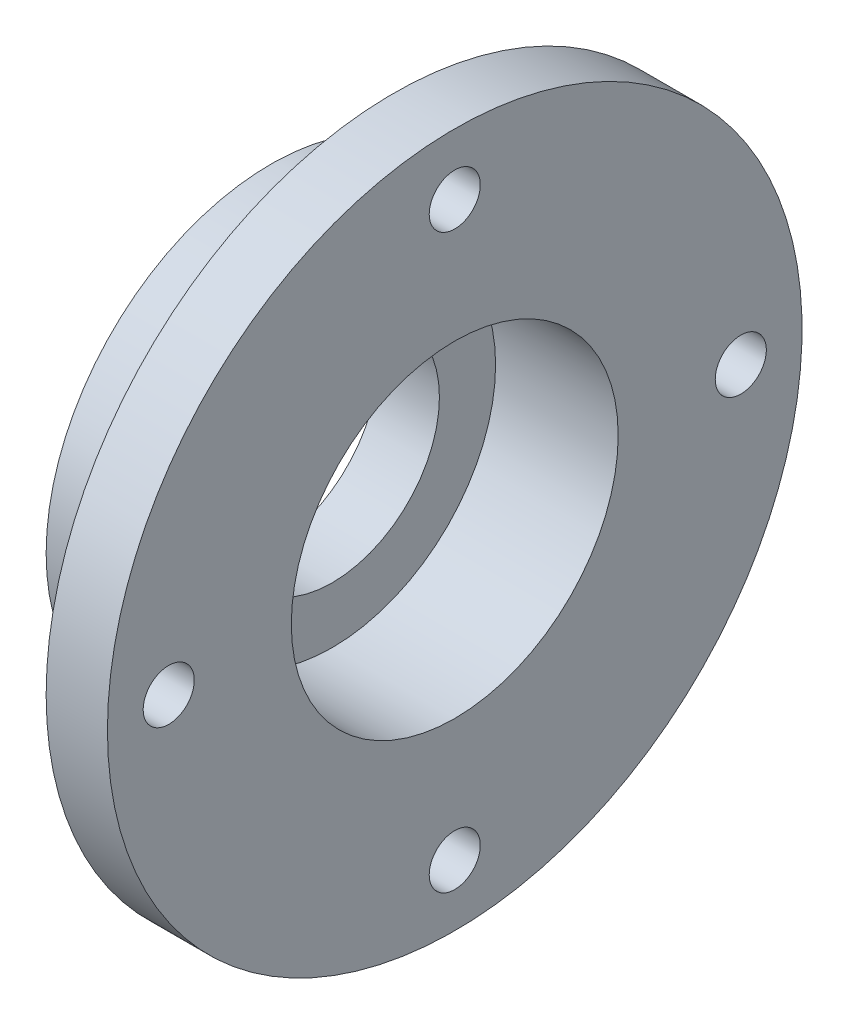
ISO-10303-21;
HEADER;
FILE_DESCRIPTION(('STEP AP214'),'2;1');
FILE_NAME('part.step','',(''),(''),'','','');
FILE_SCHEMA(('AUTOMOTIVE_DESIGN { 1 0 10303 214 1 1 1 1 }'));
ENDSEC;
DATA;
#1=APPLICATION_CONTEXT('core data for automotive mechanical design processes');
#2=APPLICATION_PROTOCOL_DEFINITION('international standard','automotive_design',2000,#1);
#3=PRODUCT_CONTEXT('',#1,'mechanical');
#4=PRODUCT('Part','Part','',(#3));
#5=PRODUCT_RELATED_PRODUCT_CATEGORY('part','',(#4));
#6=PRODUCT_DEFINITION_FORMATION('','',#4);
#7=PRODUCT_DEFINITION_CONTEXT('part definition',#1,'design');
#8=PRODUCT_DEFINITION('design','',#6,#7);
#9=PRODUCT_DEFINITION_SHAPE('','',#8);
#10=(LENGTH_UNIT() NAMED_UNIT(*) SI_UNIT(.MILLI.,.METRE.));
#11=(NAMED_UNIT(*) PLANE_ANGLE_UNIT() SI_UNIT($,.RADIAN.));
#12=(NAMED_UNIT(*) SI_UNIT($,.STERADIAN.) SOLID_ANGLE_UNIT());
#13=UNCERTAINTY_MEASURE_WITH_UNIT(LENGTH_MEASURE(1.E-05),#10,'distance_accuracy_value','');
#14=(GEOMETRIC_REPRESENTATION_CONTEXT(3) GLOBAL_UNCERTAINTY_ASSIGNED_CONTEXT((#13)) GLOBAL_UNIT_ASSIGNED_CONTEXT((#10,
#11,#12)) REPRESENTATION_CONTEXT('',''));
#15=CARTESIAN_POINT('',(0.,0.,0.));
#16=DIRECTION('',(0.,0.,1.));
#17=DIRECTION('',(1.,0.,0.));
#18=AXIS2_PLACEMENT_3D('',#15,#16,#17);
#19=CARTESIAN_POINT('',(-18.,0.,0.));
#20=DIRECTION('',(1.,0.,0.));
#21=DIRECTION('',(0.,0.,-1.));
#22=AXIS2_PLACEMENT_3D('',#19,#20,#21);
#23=PLANE('',#22);
#24=CARTESIAN_POINT('',(-18.,0.,0.));
#25=DIRECTION('',(-1.,0.,0.));
#26=DIRECTION('',(0.,0.,1.));
#27=AXIS2_PLACEMENT_3D('',#24,#25,#26);
#28=CIRCLE('',#27,10.5);
#29=CARTESIAN_POINT('',(-18.,0.,10.5));
#30=VERTEX_POINT('',#29);
#31=EDGE_CURVE('E10',#30,#30,#28,.T.);
#32=ORIENTED_EDGE('',*,*,#31,.F.);
#33=EDGE_LOOP('',(#32));
#34=FACE_BOUND('',#33,.T.);
#35=CARTESIAN_POINT('',(-18.,0.,0.));
#36=DIRECTION('',(-1.,0.,0.));
#37=DIRECTION('',(0.,0.,1.));
#38=AXIS2_PLACEMENT_3D('',#35,#36,#37);
#39=CIRCLE('',#38,22.);
#40=CARTESIAN_POINT('',(-18.,0.,22.));
#41=VERTEX_POINT('',#40);
#42=EDGE_CURVE('E67',#41,#41,#39,.T.);
#43=ORIENTED_EDGE('',*,*,#42,.T.);
#44=EDGE_LOOP('',(#43));
#45=FACE_BOUND('',#44,.T.);
#46=ADVANCED_FACE('F39',(#34,#45),#23,.F.);
#47=CARTESIAN_POINT('',(-41.9626961555855,0.,0.));
#48=DIRECTION('',(-1.,0.,0.));
#49=DIRECTION('',(0.,0.,1.));
#50=AXIS2_PLACEMENT_3D('',#47,#48,#49);
#51=CYLINDRICAL_SURFACE('',#50,10.5);
#52=CARTESIAN_POINT('',(-12.,0.,0.));
#53=DIRECTION('',(-1.,0.,0.));
#54=DIRECTION('',(0.,0.,1.));
#55=AXIS2_PLACEMENT_3D('',#52,#53,#54);
#56=CIRCLE('',#55,10.5);
#57=CARTESIAN_POINT('',(-12.,0.,10.5));
#58=VERTEX_POINT('',#57);
#59=EDGE_CURVE('E45',#58,#58,#56,.T.);
#60=ORIENTED_EDGE('',*,*,#59,.F.);
#61=EDGE_LOOP('',(#60));
#62=FACE_BOUND('',#61,.T.);
#63=ORIENTED_EDGE('',*,*,#31,.T.);
#64=EDGE_LOOP('',(#63));
#65=FACE_BOUND('',#64,.T.);
#66=ADVANCED_FACE('F137',(#62,#65),#51,.F.);
#67=CARTESIAN_POINT('',(-12.,0.,0.));
#68=DIRECTION('',(1.,0.,0.));
#69=DIRECTION('',(0.,0.,-1.));
#70=AXIS2_PLACEMENT_3D('',#67,#68,#69);
#71=PLANE('',#70);
#72=ORIENTED_EDGE('',*,*,#59,.T.);
#73=EDGE_LOOP('',(#72));
#74=FACE_BOUND('',#73,.T.);
#75=CARTESIAN_POINT('',(-12.,0.,0.));
#76=DIRECTION('',(-1.,0.,0.));
#77=DIRECTION('',(0.,0.,1.));
#78=AXIS2_PLACEMENT_3D('',#75,#76,#77);
#79=CIRCLE('',#78,16.);
#80=CARTESIAN_POINT('',(-12.,0.,16.));
#81=VERTEX_POINT('',#80);
#82=EDGE_CURVE('E49',#81,#81,#79,.T.);
#83=ORIENTED_EDGE('',*,*,#82,.F.);
#84=EDGE_LOOP('',(#83));
#85=FACE_BOUND('',#84,.T.);
#86=ADVANCED_FACE('F133',(#74,#85),#71,.T.);
#87=CARTESIAN_POINT('',(-41.9626961555855,0.,0.));
#88=DIRECTION('',(-1.,0.,0.));
#89=DIRECTION('',(0.,0.,1.));
#90=AXIS2_PLACEMENT_3D('',#87,#88,#89);
#91=CYLINDRICAL_SURFACE('',#90,16.);
#92=ORIENTED_EDGE('',*,*,#82,.T.);
#93=EDGE_LOOP('',(#92));
#94=FACE_BOUND('',#93,.T.);
#95=CARTESIAN_POINT('',(0.,0.,0.));
#96=DIRECTION('',(-1.,0.,0.));
#97=DIRECTION('',(0.,0.,1.));
#98=AXIS2_PLACEMENT_3D('',#95,#96,#97);
#99=CIRCLE('',#98,16.);
#100=CARTESIAN_POINT('',(0.,0.,16.));
#101=VERTEX_POINT('',#100);
#102=EDGE_CURVE('E53',#101,#101,#99,.T.);
#103=ORIENTED_EDGE('',*,*,#102,.F.);
#104=EDGE_LOOP('',(#103));
#105=FACE_BOUND('',#104,.T.);
#106=ADVANCED_FACE('F127',(#94,#105),#91,.F.);
#107=CARTESIAN_POINT('',(0.,0.,0.));
#108=DIRECTION('',(1.,0.,0.));
#109=DIRECTION('',(0.,0.,-1.));
#110=AXIS2_PLACEMENT_3D('',#107,#108,#109);
#111=PLANE('',#110);
#112=CARTESIAN_POINT('',(0.,0.,28.));
#113=DIRECTION('',(-1.,0.,0.));
#114=DIRECTION('',(0.,0.,1.));
#115=AXIS2_PLACEMENT_3D('',#112,#113,#114);
#116=CIRCLE('',#115,2.5);
#117=CARTESIAN_POINT('',(0.,0.,30.5));
#118=VERTEX_POINT('',#117);
#119=EDGE_CURVE('E74',#118,#118,#116,.T.);
#120=ORIENTED_EDGE('',*,*,#119,.T.);
#121=EDGE_LOOP('',(#120));
#122=FACE_BOUND('',#121,.T.);
#123=CARTESIAN_POINT('',(0.,-28.,0.));
#124=DIRECTION('',(-1.,0.,0.));
#125=DIRECTION('',(0.,0.,1.));
#126=AXIS2_PLACEMENT_3D('',#123,#124,#125);
#127=CIRCLE('',#126,2.5);
#128=CARTESIAN_POINT('',(0.,-28.,2.5));
#129=VERTEX_POINT('',#128);
#130=EDGE_CURVE('E86',#129,#129,#127,.T.);
#131=ORIENTED_EDGE('',*,*,#130,.T.);
#132=EDGE_LOOP('',(#131));
#133=FACE_BOUND('',#132,.T.);
#134=CARTESIAN_POINT('',(0.,0.,-28.));
#135=DIRECTION('',(-1.,0.,0.));
#136=DIRECTION('',(0.,0.,1.));
#137=AXIS2_PLACEMENT_3D('',#134,#135,#136);
#138=CIRCLE('',#137,2.5);
#139=CARTESIAN_POINT('',(0.,0.,-25.5));
#140=VERTEX_POINT('',#139);
#141=EDGE_CURVE('E80',#140,#140,#138,.T.);
#142=ORIENTED_EDGE('',*,*,#141,.T.);
#143=EDGE_LOOP('',(#142));
#144=FACE_BOUND('',#143,.T.);
#145=CARTESIAN_POINT('',(0.,28.,0.));
#146=DIRECTION('',(-1.,0.,0.));
#147=DIRECTION('',(0.,0.,1.));
#148=AXIS2_PLACEMENT_3D('',#145,#146,#147);
#149=CIRCLE('',#148,2.5);
#150=CARTESIAN_POINT('',(0.,28.,2.5));
#151=VERTEX_POINT('',#150);
#152=EDGE_CURVE('E70',#151,#151,#149,.T.);
#153=ORIENTED_EDGE('',*,*,#152,.T.);
#154=EDGE_LOOP('',(#153));
#155=FACE_BOUND('',#154,.T.);
#156=ORIENTED_EDGE('',*,*,#102,.T.);
#157=EDGE_LOOP('',(#156));
#158=FACE_BOUND('',#157,.T.);
#159=CARTESIAN_POINT('',(0.,0.,0.));
#160=DIRECTION('',(-1.,0.,0.));
#161=DIRECTION('',(0.,0.,1.));
#162=AXIS2_PLACEMENT_3D('',#159,#160,#161);
#163=CIRCLE('',#162,34.);
#164=CARTESIAN_POINT('',(0.,0.,34.));
#165=VERTEX_POINT('',#164);
#166=EDGE_CURVE('E58',#165,#165,#163,.T.);
#167=ORIENTED_EDGE('',*,*,#166,.F.);
#168=EDGE_LOOP('',(#167));
#169=FACE_BOUND('',#168,.T.);
#170=ADVANCED_FACE('F95',(#122,#133,#144,#155,#158,#169),#111,.T.);
#171=CARTESIAN_POINT('',(-41.9626961555855,0.,0.));
#172=DIRECTION('',(-1.,0.,0.));
#173=DIRECTION('',(0.,0.,1.));
#174=AXIS2_PLACEMENT_3D('',#171,#172,#173);
#175=CYLINDRICAL_SURFACE('',#174,34.);
#176=CARTESIAN_POINT('',(-6.00000000000001,0.,0.));
#177=DIRECTION('',(-1.,0.,0.));
#178=DIRECTION('',(0.,0.,1.));
#179=AXIS2_PLACEMENT_3D('',#176,#177,#178);
#180=CIRCLE('',#179,34.);
#181=CARTESIAN_POINT('',(-6.00000000000001,0.,34.));
#182=VERTEX_POINT('',#181);
#183=EDGE_CURVE('E61',#182,#182,#180,.T.);
#184=ORIENTED_EDGE('',*,*,#183,.F.);
#185=EDGE_LOOP('',(#184));
#186=FACE_BOUND('',#185,.T.);
#187=ORIENTED_EDGE('',*,*,#166,.T.);
#188=EDGE_LOOP('',(#187));
#189=FACE_BOUND('',#188,.T.);
#190=ADVANCED_FACE('F109',(#186,#189),#175,.T.);
#191=CARTESIAN_POINT('',(-6.00000000000001,0.,0.));
#192=DIRECTION('',(1.,0.,0.));
#193=DIRECTION('',(0.,0.,-1.));
#194=AXIS2_PLACEMENT_3D('',#191,#192,#193);
#195=PLANE('',#194);
#196=CARTESIAN_POINT('',(-6.00000000000001,0.,28.));
#197=DIRECTION('',(-1.,0.,0.));
#198=DIRECTION('',(0.,0.,1.));
#199=AXIS2_PLACEMENT_3D('',#196,#197,#198);
#200=CIRCLE('',#199,2.5);
#201=CARTESIAN_POINT('',(-6.00000000000001,0.,30.5));
#202=VERTEX_POINT('',#201);
#203=EDGE_CURVE('E89',#202,#202,#200,.T.);
#204=ORIENTED_EDGE('',*,*,#203,.F.);
#205=EDGE_LOOP('',(#204));
#206=FACE_BOUND('',#205,.T.);
#207=CARTESIAN_POINT('',(-6.00000000000001,-28.,0.));
#208=DIRECTION('',(-1.,0.,0.));
#209=DIRECTION('',(0.,0.,1.));
#210=AXIS2_PLACEMENT_3D('',#207,#208,#209);
#211=CIRCLE('',#210,2.5);
#212=CARTESIAN_POINT('',(-6.00000000000001,-28.,2.5));
#213=VERTEX_POINT('',#212);
#214=EDGE_CURVE('E83',#213,#213,#211,.T.);
#215=ORIENTED_EDGE('',*,*,#214,.F.);
#216=EDGE_LOOP('',(#215));
#217=FACE_BOUND('',#216,.T.);
#218=CARTESIAN_POINT('',(-6.00000000000001,0.,-28.));
#219=DIRECTION('',(-1.,0.,0.));
#220=DIRECTION('',(0.,0.,1.));
#221=AXIS2_PLACEMENT_3D('',#218,#219,#220);
#222=CIRCLE('',#221,2.5);
#223=CARTESIAN_POINT('',(-6.00000000000001,0.,-25.5));
#224=VERTEX_POINT('',#223);
#225=EDGE_CURVE('E77',#224,#224,#222,.T.);
#226=ORIENTED_EDGE('',*,*,#225,.F.);
#227=EDGE_LOOP('',(#226));
#228=FACE_BOUND('',#227,.T.);
#229=CARTESIAN_POINT('',(-6.00000000000001,28.,0.));
#230=DIRECTION('',(-1.,0.,0.));
#231=DIRECTION('',(0.,0.,1.));
#232=AXIS2_PLACEMENT_3D('',#229,#230,#231);
#233=CIRCLE('',#232,2.5);
#234=CARTESIAN_POINT('',(-6.00000000000001,28.,2.5));
#235=VERTEX_POINT('',#234);
#236=EDGE_CURVE('E71',#235,#235,#233,.T.);
#237=ORIENTED_EDGE('',*,*,#236,.F.);
#238=EDGE_LOOP('',(#237));
#239=FACE_BOUND('',#238,.T.);
#240=CARTESIAN_POINT('',(-6.00000000000001,0.,0.));
#241=DIRECTION('',(-1.,0.,0.));
#242=DIRECTION('',(0.,0.,1.));
#243=AXIS2_PLACEMENT_3D('',#240,#241,#242);
#244=CIRCLE('',#243,22.);
#245=CARTESIAN_POINT('',(-6.00000000000001,0.,22.));
#246=VERTEX_POINT('',#245);
#247=EDGE_CURVE('E64',#246,#246,#244,.T.);
#248=ORIENTED_EDGE('',*,*,#247,.F.);
#249=EDGE_LOOP('',(#248));
#250=FACE_BOUND('',#249,.T.);
#251=ORIENTED_EDGE('',*,*,#183,.T.);
#252=EDGE_LOOP('',(#251));
#253=FACE_BOUND('',#252,.T.);
#254=ADVANCED_FACE('F105',(#206,#217,#228,#239,#250,#253),#195,.F.);
#255=CARTESIAN_POINT('',(-41.9626961555855,0.,0.));
#256=DIRECTION('',(-1.,0.,0.));
#257=DIRECTION('',(0.,0.,1.));
#258=AXIS2_PLACEMENT_3D('',#255,#256,#257);
#259=CYLINDRICAL_SURFACE('',#258,22.);
#260=ORIENTED_EDGE('',*,*,#42,.F.);
#261=EDGE_LOOP('',(#260));
#262=FACE_BOUND('',#261,.T.);
#263=ORIENTED_EDGE('',*,*,#247,.T.);
#264=EDGE_LOOP('',(#263));
#265=FACE_BOUND('',#264,.T.);
#266=ADVANCED_FACE('F108',(#262,#265),#259,.T.);
#267=CARTESIAN_POINT('',(0.,28.,0.));
#268=DIRECTION('',(-1.,0.,0.));
#269=DIRECTION('',(0.,0.,1.));
#270=AXIS2_PLACEMENT_3D('',#267,#268,#269);
#271=CYLINDRICAL_SURFACE('',#270,2.5);
#272=ORIENTED_EDGE('',*,*,#152,.F.);
#273=EDGE_LOOP('',(#272));
#274=FACE_BOUND('',#273,.T.);
#275=ORIENTED_EDGE('',*,*,#236,.T.);
#276=EDGE_LOOP('',(#275));
#277=FACE_BOUND('',#276,.T.);
#278=ADVANCED_FACE('F147',(#274,#277),#271,.F.);
#279=CARTESIAN_POINT('',(0.,0.,-28.));
#280=DIRECTION('',(-1.,0.,0.));
#281=DIRECTION('',(0.,0.,1.));
#282=AXIS2_PLACEMENT_3D('',#279,#280,#281);
#283=CYLINDRICAL_SURFACE('',#282,2.5);
#284=ORIENTED_EDGE('',*,*,#141,.F.);
#285=EDGE_LOOP('',(#284));
#286=FACE_BOUND('',#285,.T.);
#287=ORIENTED_EDGE('',*,*,#225,.T.);
#288=EDGE_LOOP('',(#287));
#289=FACE_BOUND('',#288,.T.);
#290=ADVANCED_FACE('F152',(#286,#289),#283,.F.);
#291=CARTESIAN_POINT('',(0.,-28.,0.));
#292=DIRECTION('',(-1.,0.,0.));
#293=DIRECTION('',(0.,0.,1.));
#294=AXIS2_PLACEMENT_3D('',#291,#292,#293);
#295=CYLINDRICAL_SURFACE('',#294,2.5);
#296=ORIENTED_EDGE('',*,*,#130,.F.);
#297=EDGE_LOOP('',(#296));
#298=FACE_BOUND('',#297,.T.);
#299=ORIENTED_EDGE('',*,*,#214,.T.);
#300=EDGE_LOOP('',(#299));
#301=FACE_BOUND('',#300,.T.);
#302=ADVANCED_FACE('F101',(#298,#301),#295,.F.);
#303=CARTESIAN_POINT('',(0.,0.,28.));
#304=DIRECTION('',(-1.,0.,0.));
#305=DIRECTION('',(0.,0.,1.));
#306=AXIS2_PLACEMENT_3D('',#303,#304,#305);
#307=CYLINDRICAL_SURFACE('',#306,2.5);
#308=ORIENTED_EDGE('',*,*,#119,.F.);
#309=EDGE_LOOP('',(#308));
#310=FACE_BOUND('',#309,.T.);
#311=ORIENTED_EDGE('',*,*,#203,.T.);
#312=EDGE_LOOP('',(#311));
#313=FACE_BOUND('',#312,.T.);
#314=ADVANCED_FACE('F98',(#310,#313),#307,.F.);
#315=CLOSED_SHELL('',(#46,#66,#86,#106,#170,#190,#254,#266,#278,#290,#302,#314));
#316=MANIFOLD_SOLID_BREP('B2',#315);
#317=ADVANCED_BREP_SHAPE_REPRESENTATION('',(#18,#316),#14);
#318=SHAPE_DEFINITION_REPRESENTATION(#9,#317);
ENDSEC;
END-ISO-10303-21;
